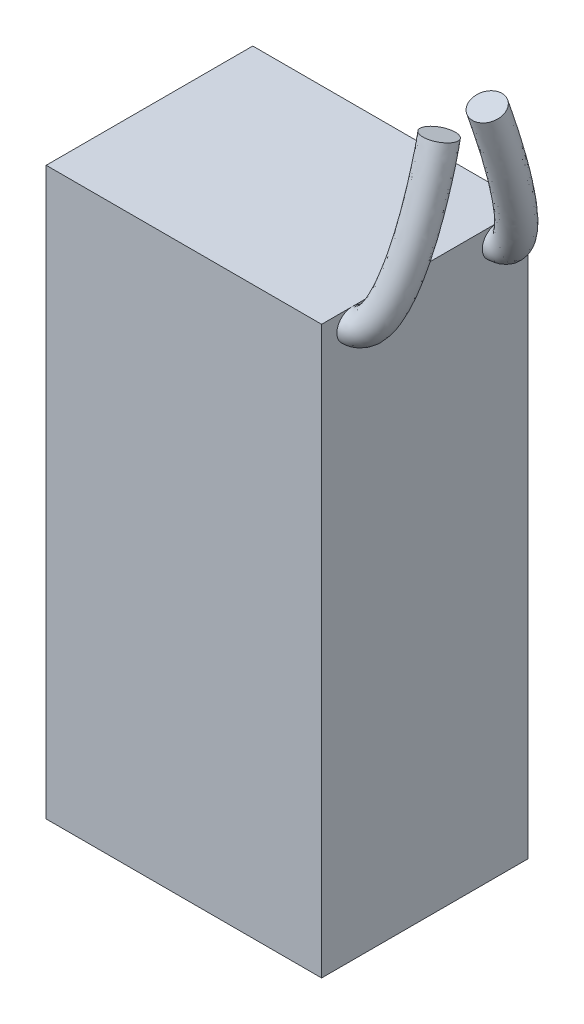
ISO-10303-21;
HEADER;
FILE_DESCRIPTION(('STEP AP214'),'2;1');
FILE_NAME('part.step','',(''),(''),'','','');
FILE_SCHEMA(('AUTOMOTIVE_DESIGN { 1 0 10303 214 1 1 1 1 }'));
ENDSEC;
DATA;
#1=APPLICATION_CONTEXT('core data for automotive mechanical design processes');
#2=APPLICATION_PROTOCOL_DEFINITION('international standard','automotive_design',2000,#1);
#3=PRODUCT_CONTEXT('',#1,'mechanical');
#4=PRODUCT('Part','Part','',(#3));
#5=PRODUCT_RELATED_PRODUCT_CATEGORY('part','',(#4));
#6=PRODUCT_DEFINITION_FORMATION('','',#4);
#7=PRODUCT_DEFINITION_CONTEXT('part definition',#1,'design');
#8=PRODUCT_DEFINITION('design','',#6,#7);
#9=PRODUCT_DEFINITION_SHAPE('','',#8);
#10=(LENGTH_UNIT() NAMED_UNIT(*) SI_UNIT(.MILLI.,.METRE.));
#11=(NAMED_UNIT(*) PLANE_ANGLE_UNIT() SI_UNIT($,.RADIAN.));
#12=(NAMED_UNIT(*) SI_UNIT($,.STERADIAN.) SOLID_ANGLE_UNIT());
#13=UNCERTAINTY_MEASURE_WITH_UNIT(LENGTH_MEASURE(1.E-05),#10,'distance_accuracy_value','');
#14=(GEOMETRIC_REPRESENTATION_CONTEXT(3) GLOBAL_UNCERTAINTY_ASSIGNED_CONTEXT((#13)) GLOBAL_UNIT_ASSIGNED_CONTEXT((#10,
#11,#12)) REPRESENTATION_CONTEXT('',''));
#15=CARTESIAN_POINT('',(0.,0.,0.));
#16=DIRECTION('',(0.,0.,1.));
#17=DIRECTION('',(1.,0.,0.));
#18=AXIS2_PLACEMENT_3D('',#15,#16,#17);
#19=CARTESIAN_POINT('',(18.,74.,-13.5));
#20=DIRECTION('',(-1.,0.,0.));
#21=DIRECTION('',(0.,0.,1.));
#22=AXIS2_PLACEMENT_3D('',#19,#20,#21);
#23=PLANE('',#22);
#24=CARTESIAN_POINT('',(18.,72.,-9.5));
#25=DIRECTION('',(1.,0.,0.));
#26=DIRECTION('',(0.,0.,-1.));
#27=AXIS2_PLACEMENT_3D('',#24,#25,#26);
#28=CIRCLE('',#27,2.);
#29=CARTESIAN_POINT('',(18.,74.,-9.50000000000001));
#30=VERTEX_POINT('',#29);
#31=EDGE_CURVE('E51',#30,#30,#28,.T.);
#32=ORIENTED_EDGE('',*,*,#31,.F.);
#33=DIRECTION('',(0.,0.,-1.));
#34=VECTOR('',#33,1.);
#35=CARTESIAN_POINT('',(18.,74.,-13.5));
#36=LINE('',#35,#34);
#37=CARTESIAN_POINT('',(18.,74.,9.49999999999993));
#38=VERTEX_POINT('',#37);
#39=EDGE_CURVE('E102',#38,#30,#36,.T.);
#40=ORIENTED_EDGE('',*,*,#39,.F.);
#41=CARTESIAN_POINT('',(18.,72.,9.5));
#42=DIRECTION('',(1.,0.,0.));
#43=DIRECTION('',(0.,0.,-1.));
#44=AXIS2_PLACEMENT_3D('',#41,#42,#43);
#45=CIRCLE('',#44,2.);
#46=EDGE_CURVE('E56',#38,#38,#45,.T.);
#47=ORIENTED_EDGE('',*,*,#46,.F.);
#48=CARTESIAN_POINT('',(18.,74.,13.5));
#49=VERTEX_POINT('',#48);
#50=EDGE_CURVE('E98',#49,#38,#36,.T.);
#51=ORIENTED_EDGE('',*,*,#50,.F.);
#52=DIRECTION('',(0.,-1.,0.));
#53=VECTOR('',#52,1.);
#54=CARTESIAN_POINT('',(18.,74.,13.5));
#55=LINE('',#54,#53);
#56=CARTESIAN_POINT('',(18.,0.,13.5));
#57=VERTEX_POINT('',#56);
#58=EDGE_CURVE('E109',#49,#57,#55,.T.);
#59=ORIENTED_EDGE('',*,*,#58,.T.);
#60=DIRECTION('',(0.,0.,-1.));
#61=VECTOR('',#60,1.);
#62=CARTESIAN_POINT('',(18.,0.,-13.5));
#63=LINE('',#62,#61);
#64=CARTESIAN_POINT('',(18.,0.,-13.5));
#65=VERTEX_POINT('',#64);
#66=EDGE_CURVE('E97',#57,#65,#63,.T.);
#67=ORIENTED_EDGE('',*,*,#66,.T.);
#68=DIRECTION('',(0.,-1.,0.));
#69=VECTOR('',#68,1.);
#70=CARTESIAN_POINT('',(18.,74.,-13.5));
#71=LINE('',#70,#69);
#72=CARTESIAN_POINT('',(18.,74.,-13.5));
#73=VERTEX_POINT('',#72);
#74=EDGE_CURVE('E11',#73,#65,#71,.T.);
#75=ORIENTED_EDGE('',*,*,#74,.F.);
#76=EDGE_CURVE('E103',#30,#73,#36,.T.);
#77=ORIENTED_EDGE('',*,*,#76,.F.);
#78=EDGE_LOOP('',(#32,#40,#47,#51,#59,#67,#75,#77));
#79=FACE_BOUND('',#78,.T.);
#80=ADVANCED_FACE('F37',(#79),#23,.F.);
#81=CARTESIAN_POINT('',(-18.,74.,-13.5));
#82=DIRECTION('',(0.,0.,1.));
#83=DIRECTION('',(1.,0.,0.));
#84=AXIS2_PLACEMENT_3D('',#81,#82,#83);
#85=PLANE('',#84);
#86=DIRECTION('',(-1.,0.,0.));
#87=VECTOR('',#86,1.);
#88=CARTESIAN_POINT('',(-18.,0.,-13.5));
#89=LINE('',#88,#87);
#90=CARTESIAN_POINT('',(-18.,0.,-13.5));
#91=VERTEX_POINT('',#90);
#92=EDGE_CURVE('E112',#65,#91,#89,.T.);
#93=ORIENTED_EDGE('',*,*,#92,.T.);
#94=DIRECTION('',(0.,-1.,0.));
#95=VECTOR('',#94,1.);
#96=CARTESIAN_POINT('',(-18.,74.,-13.5));
#97=LINE('',#96,#95);
#98=CARTESIAN_POINT('',(-18.,74.,-13.5));
#99=VERTEX_POINT('',#98);
#100=EDGE_CURVE('E44',#99,#91,#97,.T.);
#101=ORIENTED_EDGE('',*,*,#100,.F.);
#102=DIRECTION('',(-1.,0.,0.));
#103=VECTOR('',#102,1.);
#104=CARTESIAN_POINT('',(-18.,74.,-13.5));
#105=LINE('',#104,#103);
#106=EDGE_CURVE('E101',#73,#99,#105,.T.);
#107=ORIENTED_EDGE('',*,*,#106,.F.);
#108=ORIENTED_EDGE('',*,*,#74,.T.);
#109=EDGE_LOOP('',(#93,#101,#107,#108));
#110=FACE_BOUND('',#109,.T.);
#111=ADVANCED_FACE('F163',(#110),#85,.F.);
#112=CARTESIAN_POINT('',(-18.,74.,-13.5));
#113=DIRECTION('',(1.,0.,0.));
#114=DIRECTION('',(0.,0.,-1.));
#115=AXIS2_PLACEMENT_3D('',#112,#113,#114);
#116=PLANE('',#115);
#117=DIRECTION('',(0.,0.,1.));
#118=VECTOR('',#117,1.);
#119=CARTESIAN_POINT('',(-18.,0.,-13.5));
#120=LINE('',#119,#118);
#121=CARTESIAN_POINT('',(-18.,0.,13.5));
#122=VERTEX_POINT('',#121);
#123=EDGE_CURVE('E114',#91,#122,#120,.T.);
#124=ORIENTED_EDGE('',*,*,#123,.T.);
#125=DIRECTION('',(0.,-1.,0.));
#126=VECTOR('',#125,1.);
#127=CARTESIAN_POINT('',(-18.,74.,13.5));
#128=LINE('',#127,#126);
#129=CARTESIAN_POINT('',(-18.,74.,13.5));
#130=VERTEX_POINT('',#129);
#131=EDGE_CURVE('E120',#130,#122,#128,.T.);
#132=ORIENTED_EDGE('',*,*,#131,.F.);
#133=DIRECTION('',(0.,0.,1.));
#134=VECTOR('',#133,1.);
#135=CARTESIAN_POINT('',(-18.,74.,-13.5));
#136=LINE('',#135,#134);
#137=EDGE_CURVE('E105',#99,#130,#136,.T.);
#138=ORIENTED_EDGE('',*,*,#137,.F.);
#139=ORIENTED_EDGE('',*,*,#100,.T.);
#140=EDGE_LOOP('',(#124,#132,#138,#139));
#141=FACE_BOUND('',#140,.T.);
#142=ADVANCED_FACE('F127',(#141),#116,.F.);
#143=CARTESIAN_POINT('',(-18.,74.,13.5));
#144=DIRECTION('',(0.,0.,-1.));
#145=DIRECTION('',(-1.,0.,0.));
#146=AXIS2_PLACEMENT_3D('',#143,#144,#145);
#147=PLANE('',#146);
#148=DIRECTION('',(1.,0.,0.));
#149=VECTOR('',#148,1.);
#150=CARTESIAN_POINT('',(-18.,0.,13.5));
#151=LINE('',#150,#149);
#152=EDGE_CURVE('E116',#122,#57,#151,.T.);
#153=ORIENTED_EDGE('',*,*,#152,.T.);
#154=ORIENTED_EDGE('',*,*,#58,.F.);
#155=DIRECTION('',(1.,0.,0.));
#156=VECTOR('',#155,1.);
#157=CARTESIAN_POINT('',(-18.,74.,13.5));
#158=LINE('',#157,#156);
#159=EDGE_CURVE('E107',#130,#49,#158,.T.);
#160=ORIENTED_EDGE('',*,*,#159,.F.);
#161=ORIENTED_EDGE('',*,*,#131,.T.);
#162=EDGE_LOOP('',(#153,#154,#160,#161));
#163=FACE_BOUND('',#162,.T.);
#164=ADVANCED_FACE('F137',(#163),#147,.F.);
#165=CARTESIAN_POINT('',(0.,74.,0.));
#166=DIRECTION('',(0.,1.,0.));
#167=DIRECTION('',(0.,0.,1.));
#168=AXIS2_PLACEMENT_3D('',#165,#166,#167);
#169=PLANE('',#168);
#170=ORIENTED_EDGE('',*,*,#50,.T.);
#171=ORIENTED_EDGE('',*,*,#39,.T.);
#172=ORIENTED_EDGE('',*,*,#76,.T.);
#173=ORIENTED_EDGE('',*,*,#106,.T.);
#174=ORIENTED_EDGE('',*,*,#137,.T.);
#175=ORIENTED_EDGE('',*,*,#159,.T.);
#176=EDGE_LOOP('',(#170,#171,#172,#173,#174,#175));
#177=FACE_BOUND('',#176,.T.);
#178=ADVANCED_FACE('F142',(#177),#169,.T.);
#179=CARTESIAN_POINT('',(0.,0.,0.));
#180=DIRECTION('',(0.,1.,0.));
#181=DIRECTION('',(0.,0.,1.));
#182=AXIS2_PLACEMENT_3D('',#179,#180,#181);
#183=PLANE('',#182);
#184=ORIENTED_EDGE('',*,*,#66,.F.);
#185=ORIENTED_EDGE('',*,*,#152,.F.);
#186=ORIENTED_EDGE('',*,*,#123,.F.);
#187=ORIENTED_EDGE('',*,*,#92,.F.);
#188=EDGE_LOOP('',(#184,#185,#186,#187));
#189=FACE_BOUND('',#188,.T.);
#190=ADVANCED_FACE('F134',(#189),#183,.F.);
#191=CARTESIAN_POINT('',(23.,92.7930516408373,3.14292615224168));
#192=DIRECTION('',(-0.0583049278459045,0.954677910097101,-0.291874328027517));
#193=DIRECTION('',(-0.291874328027517,-0.295898302679776,-0.909534810279251));
#194=AXIS2_PLACEMENT_3D('',#191,#192,#193);
#195=PLANE('',#194);
#196=CARTESIAN_POINT('',(23.,92.7930516408373,3.14292615224168));
#197=DIRECTION('',(-0.0583049278459045,0.954677910097101,-0.291874328027517));
#198=DIRECTION('',(-0.291874328027517,-0.295898302679776,-0.909534810279251));
#199=AXIS2_PLACEMENT_3D('',#196,#197,#198);
#200=CIRCLE('',#199,2.);
#201=CARTESIAN_POINT('',(22.416251343945,92.2012550354777,1.32385653168318));
#202=VERTEX_POINT('',#201);
#203=EDGE_CURVE('E92',#202,#202,#200,.T.);
#204=ORIENTED_EDGE('',*,*,#203,.T.);
#205=EDGE_LOOP('',(#204));
#206=FACE_BOUND('',#205,.T.);
#207=ADVANCED_FACE('F146',(#206),#195,.T.);
#208=CARTESIAN_POINT('',(18.,72.,7.5));
#209=CARTESIAN_POINT('',(18.285734831203,72.0123589563963,7.49622148784523));
#210=CARTESIAN_POINT('',(18.5431498460994,72.0738518293971,7.47742122987097));
#211=CARTESIAN_POINT('',(19.0352621167928,72.2881106378947,7.41191573834142));
#212=CARTESIAN_POINT('',(19.2705823324321,72.4423687282836,7.3647543072463));
#213=CARTESIAN_POINT('',(19.954115989827,73.0561363390297,7.17710671735431));
#214=CARTESIAN_POINT('',(20.3747994062306,73.6710535016418,6.98910767418978));
#215=CARTESIAN_POINT('',(21.0979859861277,75.2205611988384,6.51537562999921));
#216=CARTESIAN_POINT('',(21.401356989629,76.1512254871561,6.23084300292177));
#217=CARTESIAN_POINT('',(21.8941246513007,78.1986255980882,5.60488997179081));
#218=CARTESIAN_POINT('',(22.0842950812014,79.3153873321692,5.2634616457962));
#219=CARTESIAN_POINT('',(22.5137243511902,82.7662047015659,4.20844089987805));
#220=CARTESIAN_POINT('',(22.6120099130805,85.200531272549,3.4641925784119));
#221=CARTESIAN_POINT('',(22.6127733692826,88.364031931003,2.49701336633082));
#222=CARTESIAN_POINT('',(22.5887039058875,89.3374312284527,2.19941533577901));
#223=CARTESIAN_POINT('',(22.5153399016441,91.0072269306929,1.6889075578433));
#224=CARTESIAN_POINT('',(22.4659229381233,91.7045220896213,1.47572303372259));
#225=CARTESIAN_POINT('',(22.416251343945,92.2012550354777,1.32385653168317));
#226=CARTESIAN_POINT('',(18.,76.,7.5));
#227=CARTESIAN_POINT('',(17.8068877641547,76.0123589753484,7.49622148205098));
#228=CARTESIAN_POINT('',(17.5556044362614,75.9784439893624,7.50659033382103));
#229=CARTESIAN_POINT('',(17.1733073787996,75.8571017323329,7.54368838475384));
#230=CARTESIAN_POINT('',(17.0469918380126,75.7809278095362,7.56697709007984));
#231=CARTESIAN_POINT('',(16.9074823047091,75.716035496789,7.58681666107533));
#232=CARTESIAN_POINT('',(17.0952398560307,75.9242377079712,7.52316285717106));
#233=CARTESIAN_POINT('',(17.5152712307102,76.8855157898233,7.22927065413467));
#234=CARTESIAN_POINT('',(17.7540900680206,77.6089809710708,7.00808515126049));
#235=CARTESIAN_POINT('',(18.1542277102305,79.3275049415256,6.4826796466703));
#236=CARTESIAN_POINT('',(18.3213820876313,80.3227590803462,6.17839992058061));
#237=CARTESIAN_POINT('',(18.7013335035846,83.4706093570141,5.21600551037561));
#238=CARTESIAN_POINT('',(18.7934389588445,85.7833230524841,4.50893797621762));
#239=CARTESIAN_POINT('',(18.7880522313537,88.7857645984645,3.59099947634953));
#240=CARTESIAN_POINT('',(18.7632390204391,89.7105460925637,3.30826539994801));
#241=CARTESIAN_POINT('',(18.6904892706938,91.2765545389355,2.82948857047294));
#242=CARTESIAN_POINT('',(18.6416294533388,91.9245596436855,2.6313735282061));
#243=CARTESIAN_POINT('',(18.5975397035566,92.3298960829771,2.50744974240228));
#244=CARTESIAN_POINT('',(18.,76.,11.5));
#245=CARTESIAN_POINT('',(17.9532860042778,76.0123589695515,11.4962214838233));
#246=CARTESIAN_POINT('',(17.8575273673819,76.0076130933107,11.4976724437927));
#247=CARTESIAN_POINT('',(17.7425640696921,75.9888743787471,11.5034014437687));
#248=CARTESIAN_POINT('',(17.7268116751565,75.9831505923714,11.5051513808774));
#249=CARTESIAN_POINT('',(17.838931697415,76.1257454405068,11.4615557607817));
#250=CARTESIAN_POINT('',(18.097901832198,76.45829289095,11.3598858021415));
#251=CARTESIAN_POINT('',(18.6106170543555,77.5994108139612,11.011011041916));
#252=CARTESIAN_POINT('',(18.8691714694291,78.3862231194174,10.7704583795907));
#253=CARTESIAN_POINT('',(19.2976289506056,80.2052946163973,10.2143124111918));
#254=CARTESIAN_POINT('',(19.4718200414358,81.2376973551264,9.8986752183405));
#255=CARTESIAN_POINT('',(19.8668983553886,84.4781739675202,8.90796209538991));
#256=CARTESIAN_POINT('',(19.9608932588597,86.828068450311,8.18952725379384));
#257=CARTESIAN_POINT('',(19.9573868312529,89.8797507084726,7.25653435742812));
#258=CARTESIAN_POINT('',(19.9328010067686,90.8193961567297,6.96925591419291));
#259=CARTESIAN_POINT('',(19.8598634605667,92.4171355515682,6.48077796022412));
#260=CARTESIAN_POINT('',(19.8108333065523,93.0802101381671,6.27805571499774));
#261=CARTESIAN_POINT('',(19.7650370156666,93.5134892936962,6.14558898351929));
#262=CARTESIAN_POINT('',(18.,72.,11.5));
#263=CARTESIAN_POINT('',(18.432133071326,72.0123589505994,11.496221489618));
#264=CARTESIAN_POINT('',(18.84507277722,72.1030209333454,11.4685033398428));
#265=CARTESIAN_POINT('',(19.6045188076852,72.4198832843089,11.3716287973561));
#266=CARTESIAN_POINT('',(19.9504021695757,72.6445915111187,11.3029285980442));
#267=CARTESIAN_POINT('',(20.8855653825336,73.4658462827475,11.05184581706));
#268=CARTESIAN_POINT('',(21.377461382398,74.2051086846206,10.825830619161));
#269=CARTESIAN_POINT('',(22.193331809773,75.9344562229763,10.2971160177797));
#270=CARTESIAN_POINT('',(22.5164383910394,76.9284676355026,9.99321623125099));
#271=CARTESIAN_POINT('',(23.0375258916738,79.0764152729598,9.33652273631333));
#272=CARTESIAN_POINT('',(23.2347330350016,80.2303256069536,8.98373694355609));
#273=CARTESIAN_POINT('',(23.6792892030027,83.7737693120635,7.90039748489235));
#274=CARTESIAN_POINT('',(23.7794642131034,86.2452766703683,7.14478185598812));
#275=CARTESIAN_POINT('',(23.7821079691778,89.458018041015,6.16254824740941));
#276=CARTESIAN_POINT('',(23.7582658922139,90.4462812926187,5.86040585002468));
#277=CARTESIAN_POINT('',(23.68471409152,92.1478079433256,5.34019694759372));
#278=CARTESIAN_POINT('',(23.6351267913368,92.8601725841104,5.12240522051423));
#279=CARTESIAN_POINT('',(23.583748656055,93.3848482461968,4.96199577280019));
#280=CARTESIAN_POINT('',(18.,68.,11.5));
#281=CARTESIAN_POINT('',(18.9109801383743,68.0123589316473,11.4962214954127));
#282=CARTESIAN_POINT('',(19.832618187058,68.1984287733801,11.4393342358929));
#283=CARTESIAN_POINT('',(21.4664735456784,68.8508921898707,11.2398561509436));
#284=CARTESIAN_POINT('',(22.1739926639948,69.306032429866,11.100705815211));
#285=CARTESIAN_POINT('',(23.9321990676521,70.8059471249883,10.6421358733383));
#286=CARTESIAN_POINT('',(24.657020932598,71.9519244782911,10.2917754361805));
#287=CARTESIAN_POINT('',(25.7760465651904,74.2695016319913,9.58322099364346));
#288=CARTESIAN_POINT('',(26.1637053126498,75.4707121515879,9.21597408291129));
#289=CARTESIAN_POINT('',(26.777422832742,77.9475359295224,8.45873306143483));
#290=CARTESIAN_POINT('',(26.9976460285674,79.2229538587809,8.06879866877169));
#291=CARTESIAN_POINT('',(27.4916800506169,83.0693646566067,6.89283287439479));
#292=CARTESIAN_POINT('',(27.5980351673472,85.6624848904255,6.10003645818239));
#293=CARTESIAN_POINT('',(27.6068291071028,89.0362853735574,5.0685621373907));
#294=CARTESIAN_POINT('',(27.5837307776592,90.0731664285077,4.75155578585643));
#295=CARTESIAN_POINT('',(27.5095647224733,91.878480335083,4.19961593496331));
#296=CARTESIAN_POINT('',(27.4594202761213,92.6401350300537,3.96675472603072));
#297=CARTESIAN_POINT('',(27.4024602964435,93.2562071986975,3.77840256208108));
#298=CARTESIAN_POINT('',(18.,68.,7.5));
#299=CARTESIAN_POINT('',(18.7645818982512,68.0123589374442,7.49622149363948));
#300=CARTESIAN_POINT('',(19.5306952559375,68.1692596694318,7.44825212592092));
#301=CARTESIAN_POINT('',(20.8972168547859,68.7191195434565,7.280143091929));
#302=CARTESIAN_POINT('',(21.4941728268515,69.1038096470308,7.16253152441277));
#303=CARTESIAN_POINT('',(23.0007496749449,70.3962371812705,6.76739677363329));
#304=CARTESIAN_POINT('',(23.6543589564306,71.4178692953123,6.4550524912085));
#305=CARTESIAN_POINT('',(24.6807007415451,73.5556066078534,5.80148060586375));
#306=CARTESIAN_POINT('',(25.0486239112374,74.6934700032414,5.45360085458305));
#307=CARTESIAN_POINT('',(25.6340215923709,77.0697462546507,4.72710029691133));
#308=CARTESIAN_POINT('',(25.8472080747715,78.3080155839922,4.3485233710118));
#309=CARTESIAN_POINT('',(26.3261151987958,82.0618000461177,3.20087628938049));
#310=CARTESIAN_POINT('',(26.4305808673165,84.617739492614,2.41944718060617));
#311=CARTESIAN_POINT('',(26.4374945072114,87.9422992635415,1.4030272563121));
#312=CARTESIAN_POINT('',(26.4141687913358,88.9643163643417,1.09056527161001));
#313=CARTESIAN_POINT('',(26.3401905325944,90.7378993224503,0.548326545213667));
#314=CARTESIAN_POINT('',(26.2902164229078,91.4844845355572,0.320072539239081));
#315=CARTESIAN_POINT('',(26.2349629843334,92.0726139879784,0.140263320964069));
#316=CARTESIAN_POINT('',(18.,72.,7.5));
#317=CARTESIAN_POINT('',(18.285734831203,72.0123589563963,7.49622148784523));
#318=CARTESIAN_POINT('',(18.5431498460994,72.0738518293971,7.47742122987097));
#319=CARTESIAN_POINT('',(19.0352621167928,72.2881106378947,7.41191573834142));
#320=CARTESIAN_POINT('',(19.2705823324321,72.4423687282836,7.3647543072463));
#321=CARTESIAN_POINT('',(19.954115989827,73.0561363390297,7.17710671735431));
#322=CARTESIAN_POINT('',(20.3747994062306,73.6710535016418,6.98910767418978));
#323=CARTESIAN_POINT('',(21.0979859861277,75.2205611988384,6.51537562999921));
#324=CARTESIAN_POINT('',(21.401356989629,76.1512254871561,6.23084300292177));
#325=CARTESIAN_POINT('',(21.8941246513007,78.1986255980882,5.60488997179081));
#326=CARTESIAN_POINT('',(22.0842950812014,79.3153873321692,5.2634616457962));
#327=CARTESIAN_POINT('',(22.5137243511902,82.7662047015659,4.20844089987805));
#328=CARTESIAN_POINT('',(22.6120099130805,85.200531272549,3.4641925784119));
#329=CARTESIAN_POINT('',(22.6127733692826,88.364031931003,2.49701336633082));
#330=CARTESIAN_POINT('',(22.5887039058875,89.3374312284527,2.19941533577901));
#331=CARTESIAN_POINT('',(22.5153399016441,91.0072269306929,1.6889075578433));
#332=CARTESIAN_POINT('',(22.4659229381233,91.7045220896213,1.47572303372259));
#333=CARTESIAN_POINT('',(22.416251343945,92.2012550354777,1.32385653168317));
#334=(BOUNDED_SURFACE() B_SPLINE_SURFACE(3,3,((#208,#209,#210,#211,#212,#213,#214,#215,#216,
#217,#218,#219,#220,#221,#222,#223,#224,#225),(#226,#227,#228,#229,#230,#231,#232,#233,#234,
#235,#236,#237,#238,#239,#240,#241,#242,#243),(#244,#245,#246,#247,#248,#249,#250,#251,#252,
#253,#254,#255,#256,#257,#258,#259,#260,#261),(#262,#263,#264,#265,#266,#267,#268,#269,#270,
#271,#272,#273,#274,#275,#276,#277,#278,#279),(#280,#281,#282,#283,#284,#285,#286,#287,#288,
#289,#290,#291,#292,#293,#294,#295,#296,#297),(#298,#299,#300,#301,#302,#303,#304,#305,#306,
#307,#308,#309,#310,#311,#312,#313,#314,#315),(#316,#317,#318,#319,#320,#321,#322,#323,#324,
#325,#326,#327,#328,#329,#330,#331,#332,#333)),.UNSPECIFIED.,.T.,.F.,
.F.) B_SPLINE_SURFACE_WITH_KNOTS((4,3,4),(4,2,2,2,2,2,2,2,4),(0.,0.5,1.),(0.,0.0625,0.125,0.25,
0.375,0.5,0.75,0.875,1.),
.UNSPECIFIED.) GEOMETRIC_REPRESENTATION_ITEM() RATIONAL_B_SPLINE_SURFACE(((1.,1.,1.,1.,1.,1.,1.,
1.,1.,1.,1.,1.,1.,1.,1.,1.,1.,1.),(0.333333333333333,0.333333333333333,0.333333333333333,
0.333333333333333,0.333333333333333,0.333333333333333,0.333333333333333,0.333333333333333,
0.333333333333333,0.333333333333333,0.333333333333333,0.333333333333333,0.333333333333333,
0.333333333333333,0.333333333333333,0.333333333333333,0.333333333333333,0.333333333333333),
(0.333333333333333,0.333333333333333,0.333333333333333,0.333333333333333,0.333333333333333,
0.333333333333333,0.333333333333333,0.333333333333333,0.333333333333333,0.333333333333333,
0.333333333333333,0.333333333333333,0.333333333333333,0.333333333333333,0.333333333333333,
0.333333333333333,0.333333333333333,0.333333333333333),(1.,1.,1.,1.,1.,1.,1.,1.,1.,1.,1.,1.,1.,
1.,1.,1.,1.,1.),(0.333333333333333,0.333333333333333,0.333333333333333,0.333333333333333,
0.333333333333333,0.333333333333333,0.333333333333333,0.333333333333333,0.333333333333333,
0.333333333333333,0.333333333333333,0.333333333333333,0.333333333333333,0.333333333333333,
0.333333333333333,0.333333333333333,0.333333333333333,0.333333333333333),(0.333333333333333,
0.333333333333333,0.333333333333333,0.333333333333333,0.333333333333333,0.333333333333333,
0.333333333333333,0.333333333333333,0.333333333333333,0.333333333333333,0.333333333333333,
0.333333333333333,0.333333333333333,0.333333333333333,0.333333333333333,0.333333333333333,
0.333333333333333,0.333333333333333),(1.,1.,1.,1.,1.,1.,1.,1.,1.,1.,1.,1.,1.,1.,1.,1.,1.,1.))) REPRESENTATION_ITEM('') SURFACE());
#335=ORIENTED_EDGE('',*,*,#203,.F.);
#336=EDGE_LOOP('',(#335));
#337=FACE_BOUND('',#336,.T.);
#338=ORIENTED_EDGE('',*,*,#46,.T.);
#339=EDGE_LOOP('',(#338));
#340=FACE_BOUND('',#339,.T.);
#341=ADVANCED_FACE('F144',(#337,#340),#334,.T.);
#342=CARTESIAN_POINT('',(23.,92.7930516408373,-3.14292615224166));
#343=DIRECTION('',(-0.0115997870651073,0.956240415976758,0.292352034014888));
#344=DIRECTION('',(0.292352034014888,0.282839711039664,-0.913527222400273));
#345=AXIS2_PLACEMENT_3D('',#342,#343,#344);
#346=PLANE('',#345);
#347=CARTESIAN_POINT('',(23.,92.7930516408373,-3.14292615224166));
#348=DIRECTION('',(-0.0115997870651073,0.956240415976758,0.292352034014888));
#349=DIRECTION('',(0.292352034014888,0.282839711039664,-0.913527222400273));
#350=AXIS2_PLACEMENT_3D('',#347,#348,#349);
#351=CIRCLE('',#350,2.);
#352=CARTESIAN_POINT('',(23.5847040680298,93.3587310629167,-4.96998059704221));
#353=VERTEX_POINT('',#352);
#354=EDGE_CURVE('E88',#353,#353,#351,.T.);
#355=ORIENTED_EDGE('',*,*,#354,.T.);
#356=EDGE_LOOP('',(#355));
#357=FACE_BOUND('',#356,.T.);
#358=ADVANCED_FACE('F89',(#357),#346,.T.);
#359=CARTESIAN_POINT('',(18.,72.,-11.5));
#360=CARTESIAN_POINT('',(18.3002694990477,72.0129959631935,-11.49602673532));
#361=CARTESIAN_POINT('',(18.5942743722065,72.0690890230549,-11.4788773659014));
#362=CARTESIAN_POINT('',(19.1552751865381,72.2606659721812,-11.4203064146907));
#363=CARTESIAN_POINT('',(19.4220650090542,72.395730084573,-11.3790131715698));
#364=CARTESIAN_POINT('',(20.1745514442172,72.8999411117203,-11.2248603906411));
#365=CARTESIAN_POINT('',(20.6128813549558,73.3653427562275,-11.0825728287139));
#366=CARTESIAN_POINT('',(21.3922304447504,74.5027169613315,-10.734842637914));
#367=CARTESIAN_POINT('',(21.734197525732,75.1767140912429,-10.5287810360843));
#368=CARTESIAN_POINT('',(22.3383828387634,76.7152447518635,-10.058405008769));
#369=CARTESIAN_POINT('',(22.6001917971652,77.5800596835298,-9.79400455037943));
#370=CARTESIAN_POINT('',(23.2696363100667,80.4321107648156,-8.92204502972799));
#371=CARTESIAN_POINT('',(23.5614381815139,82.6775038928724,-8.23555945855078));
#372=CARTESIAN_POINT('',(23.8221987782194,87.6809079348646,-6.70586533118714));
#373=CARTESIAN_POINT('',(23.7905542493747,90.4384643287994,-5.86279573576052));
#374=CARTESIAN_POINT('',(23.5847040680298,93.3587310629167,-4.96998059704221));
#375=CARTESIAN_POINT('',(18.,76.,-11.5));
#376=CARTESIAN_POINT('',(17.9193734778596,76.0129959729265,-11.4960267323435));
#377=CARTESIAN_POINT('',(17.8243253046389,76.0113985355436,-11.496515117962));
#378=CARTESIAN_POINT('',(17.6829151910794,75.9970543020528,-11.5009005902394));
#379=CARTESIAN_POINT('',(17.6376955020387,75.9866338035906,-11.5040864563369));
#380=CARTESIAN_POINT('',(17.6118372340041,76.0203594694752,-11.4937754855229));
#381=CARTESIAN_POINT('',(17.7381381161734,76.1448099446797,-11.4557271569307));
#382=CARTESIAN_POINT('',(18.0934989593814,76.7282228296836,-11.2773599380274));
#383=CARTESIAN_POINT('',(18.3173059332948,77.1759657153081,-11.1404712004853));
#384=CARTESIAN_POINT('',(18.7486554664845,78.3375034935573,-10.7853534640042));
#385=CARTESIAN_POINT('',(18.9584661033176,79.0497389717831,-10.5676012258898));
#386=CARTESIAN_POINT('',(19.5107734604455,81.5058124266103,-9.81670421482059));
#387=CARTESIAN_POINT('',(19.7753216978403,83.5659657061672,-9.18685214875545));
#388=CARTESIAN_POINT('',(20.0002750048279,88.245467963416,-7.75618473476981));
#389=CARTESIAN_POINT('',(19.9640231324271,90.8673357716981,-6.95459930311187));
#390=CARTESIAN_POINT('',(19.7597424041228,93.6582230250552,-6.10133944120086));
#391=CARTESIAN_POINT('',(18.,76.,-7.5));
#392=CARTESIAN_POINT('',(17.8029218777345,76.0129959759039,-7.49602673143372));
#393=CARTESIAN_POINT('',(17.588928251523,75.9937607834821,-7.5019075199186));
#394=CARTESIAN_POINT('',(17.2327695663153,75.9164601265049,-7.52554070245181));
#395=CARTESIAN_POINT('',(17.0921589966848,75.8615605188238,-7.54232519692101));
#396=CARTESIAN_POINT('',(16.8283368721319,75.7514443745929,-7.57599108073565));
#397=CARTESIAN_POINT('',(16.8592409067599,75.7716556164629,-7.56981188398644));
#398=CARTESIAN_POINT('',(17.0849755344124,76.1857055295701,-7.44322412189351));
#399=CARTESIAN_POINT('',(17.2726573382699,76.5642755509164,-7.32748365128872));
#400=CARTESIAN_POINT('',(17.6511656707057,77.6105550383128,-7.00760391060907));
#401=CARTESIAN_POINT('',(17.8450788252508,78.276142296277,-6.80411346466716));
#402=CARTESIAN_POINT('',(18.3615737599237,80.611153241509,-6.0902289771535));
#403=CARTESIAN_POINT('',(18.6177897252014,82.6146730159265,-5.47769151120796));
#404=CARTESIAN_POINT('',(18.8317956451095,87.1951485598694,-4.07729960176679));
#405=CARTESIAN_POINT('',(18.7941351664347,89.7755322043863,-3.28839715175979));
#406=CARTESIAN_POINT('',(18.5903342680632,92.5268641808965,-2.44723055159977));
#407=CARTESIAN_POINT('',(18.,72.,-7.5));
#408=CARTESIAN_POINT('',(18.1838178989225,72.012995966171,-7.49602673440978));
#409=CARTESIAN_POINT('',(18.3588773190907,72.0514512709935,-7.4842697678581));
#410=CARTESIAN_POINT('',(18.705129561774,72.1800717966333,-7.44494652690298));
#411=CARTESIAN_POINT('',(18.8765285037003,72.2706567998061,-7.41725191215385));
#412=CARTESIAN_POINT('',(19.391051082345,72.631026016838,-7.30707598585392));
#413=CARTESIAN_POINT('',(19.7339841455422,72.9921884280107,-7.19665755576958));
#414=CARTESIAN_POINT('',(20.3837070197813,73.9601996612181,-6.90070682178007));
#415=CARTESIAN_POINT('',(20.6895489307071,74.5650239268484,-6.71579348688772));
#416=CARTESIAN_POINT('',(21.2408930429845,75.9882962966218,-6.28065545537389));
#417=CARTESIAN_POINT('',(21.4868045191001,76.8064630080237,-6.03051678915674));
#418=CARTESIAN_POINT('',(22.1204366095415,79.5374515797143,-5.19556979206089));
#419=CARTESIAN_POINT('',(22.4039062088749,81.7262112026317,-4.5263988209988));
#420=CARTESIAN_POINT('',(22.6537194185009,86.6305885313179,-3.02698019818863));
#421=CARTESIAN_POINT('',(22.6206662833665,89.3466607614876,-2.19659358441636));
#422=CARTESIAN_POINT('',(22.4152959319702,92.227372218758,-1.31587170744111));
#423=CARTESIAN_POINT('',(18.,68.,-7.5));
#424=CARTESIAN_POINT('',(18.5647139201106,68.012995956438,-7.49602673738583));
#425=CARTESIAN_POINT('',(19.1288263866583,68.1091417585048,-7.46663201579759));
#426=CARTESIAN_POINT('',(20.1774895572327,68.4436834667617,-7.36435235135414));
#427=CARTESIAN_POINT('',(20.6608980107157,68.6797530807886,-7.29217862738669));
#428=CARTESIAN_POINT('',(21.9537652925581,69.5106076590832,-7.03816089097219));
#429=CARTESIAN_POINT('',(22.6087273843245,70.2127212395585,-6.82350322755273));
#430=CARTESIAN_POINT('',(23.6824385051503,71.734693792866,-6.35818952166664));
#431=CARTESIAN_POINT('',(24.1064405231443,72.5657723027803,-6.10410332248672));
#432=CARTESIAN_POINT('',(24.8306204152634,74.3660375549308,-5.55370700013872));
#433=CARTESIAN_POINT('',(25.1285302129495,75.3367837197705,-5.25692011364633));
#434=CARTESIAN_POINT('',(25.8792994591592,78.4637499179196,-4.30091060696829));
#435=CARTESIAN_POINT('',(26.1900226925485,80.837749389337,-3.57510613078963));
#436=CARTESIAN_POINT('',(26.4756431918924,86.0660285027665,-1.97666079461046));
#437=CARTESIAN_POINT('',(26.4471974002982,88.9177893185888,-1.10479001707292));
#438=CARTESIAN_POINT('',(26.2402575958773,91.9278802566195,-0.184512863282454));
#439=CARTESIAN_POINT('',(18.,68.,-11.5));
#440=CARTESIAN_POINT('',(18.6811655202358,68.0129959534605,-11.4960267382966));
#441=CARTESIAN_POINT('',(19.3642234397742,68.1267795105662,-11.4612396138408));
#442=CARTESIAN_POINT('',(20.6276351819968,68.5242776423096,-11.3397122391419));
#443=CARTESIAN_POINT('',(21.2064345160696,68.8048263655555,-11.2539398868027));
#444=CARTESIAN_POINT('',(22.7372656544303,69.7795227539654,-10.9559452957592));
#445=CARTESIAN_POINT('',(23.4876245937381,70.5858755677754,-10.709418500497));
#446=CARTESIAN_POINT('',(24.6909619301194,72.2772110929795,-10.1923253378006));
#447=CARTESIAN_POINT('',(25.1510891181692,73.1774624671777,-9.91709087168334));
#448=CARTESIAN_POINT('',(25.9281102110422,75.0929860101696,-9.33145655353385));
#449=CARTESIAN_POINT('',(26.2419174910129,76.1103803952766,-9.02040787486902));
#450=CARTESIAN_POINT('',(27.0284991596879,79.3584091030209,-8.02738584463539));
#451=CARTESIAN_POINT('',(27.3475546651875,81.7890420795776,-7.28426676834612));
#452=CARTESIAN_POINT('',(27.6441225516108,87.1163479063132,-5.65554592760448));
#453=CARTESIAN_POINT('',(27.6170853663222,90.0095928859006,-4.77099216840918));
#454=CARTESIAN_POINT('',(27.4096657319368,93.0592391007782,-3.83862175288355));
#455=CARTESIAN_POINT('',(18.,72.,-11.5));
#456=CARTESIAN_POINT('',(18.3002694990477,72.0129959631935,-11.49602673532));
#457=CARTESIAN_POINT('',(18.5942743722065,72.0690890230549,-11.4788773659014));
#458=CARTESIAN_POINT('',(19.1552751865381,72.2606659721812,-11.4203064146907));
#459=CARTESIAN_POINT('',(19.4220650090542,72.395730084573,-11.3790131715698));
#460=CARTESIAN_POINT('',(20.1745514442172,72.8999411117203,-11.2248603906411));
#461=CARTESIAN_POINT('',(20.6128813549558,73.3653427562275,-11.0825728287139));
#462=CARTESIAN_POINT('',(21.3922304447504,74.5027169613315,-10.734842637914));
#463=CARTESIAN_POINT('',(21.734197525732,75.1767140912429,-10.5287810360843));
#464=CARTESIAN_POINT('',(22.3383828387634,76.7152447518635,-10.058405008769));
#465=CARTESIAN_POINT('',(22.6001917971652,77.5800596835298,-9.79400455037943));
#466=CARTESIAN_POINT('',(23.2696363100667,80.4321107648156,-8.92204502972799));
#467=CARTESIAN_POINT('',(23.5614381815139,82.6775038928724,-8.23555945855078));
#468=CARTESIAN_POINT('',(23.8221987782194,87.6809079348646,-6.70586533118714));
#469=CARTESIAN_POINT('',(23.7905542493747,90.4384643287994,-5.86279573576052));
#470=CARTESIAN_POINT('',(23.5847040680298,93.3587310629167,-4.96998059704221));
#471=(BOUNDED_SURFACE() B_SPLINE_SURFACE(3,3,((#359,#360,#361,#362,#363,#364,#365,#366,#367,
#368,#369,#370,#371,#372,#373,#374),(#375,#376,#377,#378,#379,#380,#381,#382,#383,#384,#385,
#386,#387,#388,#389,#390),(#391,#392,#393,#394,#395,#396,#397,#398,#399,#400,#401,#402,#403,
#404,#405,#406),(#407,#408,#409,#410,#411,#412,#413,#414,#415,#416,#417,#418,#419,#420,#421,
#422),(#423,#424,#425,#426,#427,#428,#429,#430,#431,#432,#433,#434,#435,#436,#437,#438),(#439,
#440,#441,#442,#443,#444,#445,#446,#447,#448,#449,#450,#451,#452,#453,#454),(#455,#456,#457,
#458,#459,#460,#461,#462,#463,#464,#465,#466,#467,#468,#469,#470)),.UNSPECIFIED.,.T.,.F.,
.F.) B_SPLINE_SURFACE_WITH_KNOTS((4,3,4),(4,2,2,2,2,2,2,4),(0.,0.5,1.),(0.,0.0625,0.125,0.25,
0.375,0.5,0.75,1.),
.UNSPECIFIED.) GEOMETRIC_REPRESENTATION_ITEM() RATIONAL_B_SPLINE_SURFACE(((1.,1.,1.,1.,1.,1.,1.,
1.,1.,1.,1.,1.,1.,1.,1.,1.),(0.333333333333333,0.333333333333333,0.333333333333333,
0.333333333333333,0.333333333333333,0.333333333333333,0.333333333333333,0.333333333333333,
0.333333333333333,0.333333333333333,0.333333333333333,0.333333333333333,0.333333333333333,
0.333333333333333,0.333333333333333,0.333333333333333),(0.333333333333333,0.333333333333333,
0.333333333333333,0.333333333333333,0.333333333333333,0.333333333333333,0.333333333333333,
0.333333333333333,0.333333333333333,0.333333333333333,0.333333333333333,0.333333333333333,
0.333333333333333,0.333333333333333,0.333333333333333,0.333333333333333),(1.,1.,1.,1.,1.,1.,1.,
1.,1.,1.,1.,1.,1.,1.,1.,1.),(0.333333333333333,0.333333333333333,0.333333333333333,
0.333333333333333,0.333333333333333,0.333333333333333,0.333333333333333,0.333333333333333,
0.333333333333333,0.333333333333333,0.333333333333333,0.333333333333333,0.333333333333333,
0.333333333333333,0.333333333333333,0.333333333333333),(0.333333333333333,0.333333333333333,
0.333333333333333,0.333333333333333,0.333333333333333,0.333333333333333,0.333333333333333,
0.333333333333333,0.333333333333333,0.333333333333333,0.333333333333333,0.333333333333333,
0.333333333333333,0.333333333333333,0.333333333333333,0.333333333333333),(1.,1.,1.,1.,1.,1.,1.,
1.,1.,1.,1.,1.,1.,1.,1.,1.))) REPRESENTATION_ITEM('') SURFACE());
#472=ORIENTED_EDGE('',*,*,#354,.F.);
#473=EDGE_LOOP('',(#472));
#474=FACE_BOUND('',#473,.T.);
#475=ORIENTED_EDGE('',*,*,#31,.T.);
#476=EDGE_LOOP('',(#475));
#477=FACE_BOUND('',#476,.T.);
#478=ADVANCED_FACE('F153',(#474,#477),#471,.T.);
#479=CLOSED_SHELL('',(#80,#111,#142,#164,#178,#190,#207,#341,#358,#478));
#480=MANIFOLD_SOLID_BREP('B2',#479);
#481=ADVANCED_BREP_SHAPE_REPRESENTATION('',(#18,#480),#14);
#482=SHAPE_DEFINITION_REPRESENTATION(#9,#481);
ENDSEC;
END-ISO-10303-21;
